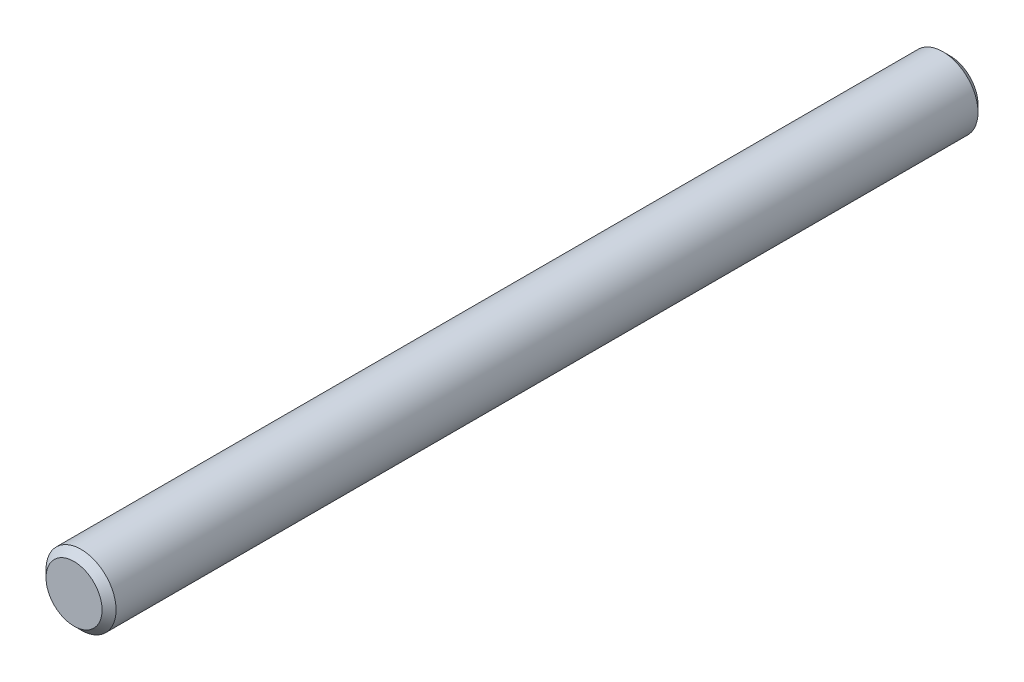
ISO-10303-21;
HEADER;
FILE_DESCRIPTION(('STEP AP214'),'2;1');
FILE_NAME('part.step','',(''),(''),'','','');
FILE_SCHEMA(('AUTOMOTIVE_DESIGN { 1 0 10303 214 1 1 1 1 }'));
ENDSEC;
DATA;
#1=APPLICATION_CONTEXT('core data for automotive mechanical design processes');
#2=APPLICATION_PROTOCOL_DEFINITION('international standard','automotive_design',2000,#1);
#3=PRODUCT_CONTEXT('',#1,'mechanical');
#4=PRODUCT('Part','Part','',(#3));
#5=PRODUCT_RELATED_PRODUCT_CATEGORY('part','',(#4));
#6=PRODUCT_DEFINITION_FORMATION('','',#4);
#7=PRODUCT_DEFINITION_CONTEXT('part definition',#1,'design');
#8=PRODUCT_DEFINITION('design','',#6,#7);
#9=PRODUCT_DEFINITION_SHAPE('','',#8);
#10=(LENGTH_UNIT() NAMED_UNIT(*) SI_UNIT(.MILLI.,.METRE.));
#11=(NAMED_UNIT(*) PLANE_ANGLE_UNIT() SI_UNIT($,.RADIAN.));
#12=(NAMED_UNIT(*) SI_UNIT($,.STERADIAN.) SOLID_ANGLE_UNIT());
#13=UNCERTAINTY_MEASURE_WITH_UNIT(LENGTH_MEASURE(1.E-05),#10,'distance_accuracy_value','');
#14=(GEOMETRIC_REPRESENTATION_CONTEXT(3) GLOBAL_UNCERTAINTY_ASSIGNED_CONTEXT((#13)) GLOBAL_UNIT_ASSIGNED_CONTEXT((#10,
#11,#12)) REPRESENTATION_CONTEXT('',''));
#15=CARTESIAN_POINT('',(0.,0.,0.));
#16=DIRECTION('',(0.,0.,1.));
#17=DIRECTION('',(1.,0.,0.));
#18=AXIS2_PLACEMENT_3D('',#15,#16,#17);
#19=CARTESIAN_POINT('',(0.,0.,100.));
#20=DIRECTION('',(0.,0.,-1.));
#21=DIRECTION('',(-1.,0.,0.));
#22=AXIS2_PLACEMENT_3D('',#19,#20,#21);
#23=CYLINDRICAL_SURFACE('',#22,4.);
#24=CARTESIAN_POINT('',(0.,0.,0.800000000000009));
#25=DIRECTION('',(0.,0.,1.));
#26=DIRECTION('',(1.,0.,0.));
#27=AXIS2_PLACEMENT_3D('',#24,#25,#26);
#28=CIRCLE('',#27,4.);
#29=CARTESIAN_POINT('',(4.,0.,0.800000000000009));
#30=VERTEX_POINT('',#29);
#31=EDGE_CURVE('E40',#30,#30,#28,.T.);
#32=ORIENTED_EDGE('',*,*,#31,.T.);
#33=EDGE_LOOP('',(#32));
#34=FACE_BOUND('',#33,.T.);
#35=CARTESIAN_POINT('',(0.,0.,99.2));
#36=DIRECTION('',(0.,0.,1.));
#37=DIRECTION('',(1.,0.,0.));
#38=AXIS2_PLACEMENT_3D('',#35,#36,#37);
#39=CIRCLE('',#38,4.);
#40=CARTESIAN_POINT('',(4.,0.,99.2));
#41=VERTEX_POINT('',#40);
#42=EDGE_CURVE('E48',#41,#41,#39,.F.);
#43=ORIENTED_EDGE('',*,*,#42,.T.);
#44=EDGE_LOOP('',(#43));
#45=FACE_BOUND('',#44,.T.);
#46=ADVANCED_FACE('F32',(#34,#45),#23,.T.);
#47=CARTESIAN_POINT('',(0.,0.,100.));
#48=DIRECTION('',(0.,0.,1.));
#49=DIRECTION('',(1.,0.,0.));
#50=AXIS2_PLACEMENT_3D('',#47,#48,#49);
#51=PLANE('',#50);
#52=CARTESIAN_POINT('',(0.,0.,100.));
#53=DIRECTION('',(0.,0.,1.));
#54=DIRECTION('',(1.,0.,0.));
#55=AXIS2_PLACEMENT_3D('',#52,#53,#54);
#56=CIRCLE('',#55,3.19999999999998);
#57=CARTESIAN_POINT('',(3.19999999999998,0.,100.));
#58=VERTEX_POINT('',#57);
#59=EDGE_CURVE('E44',#58,#58,#56,.T.);
#60=ORIENTED_EDGE('',*,*,#59,.T.);
#61=EDGE_LOOP('',(#60));
#62=FACE_BOUND('',#61,.T.);
#63=ADVANCED_FACE('F59',(#62),#51,.T.);
#64=CARTESIAN_POINT('',(0.,0.,100.));
#65=DIRECTION('',(0.,0.,-1.));
#66=DIRECTION('',(-1.,0.,0.));
#67=AXIS2_PLACEMENT_3D('',#64,#65,#66);
#68=CONICAL_SURFACE('',#67,3.19999999999998,0.785398163397455);
#69=ORIENTED_EDGE('',*,*,#42,.F.);
#70=EDGE_LOOP('',(#69));
#71=FACE_BOUND('',#70,.T.);
#72=ORIENTED_EDGE('',*,*,#59,.F.);
#73=EDGE_LOOP('',(#72));
#74=FACE_BOUND('',#73,.T.);
#75=ADVANCED_FACE('F55',(#71,#74),#68,.T.);
#76=CARTESIAN_POINT('',(-4.,4.,0.));
#77=DIRECTION('',(0.,0.,1.));
#78=DIRECTION('',(1.,0.,0.));
#79=AXIS2_PLACEMENT_3D('',#76,#77,#78);
#80=PLANE('',#79);
#81=CARTESIAN_POINT('',(0.,0.,0.));
#82=DIRECTION('',(0.,0.,1.));
#83=DIRECTION('',(1.,0.,0.));
#84=AXIS2_PLACEMENT_3D('',#81,#82,#83);
#85=CIRCLE('',#84,3.19999999999999);
#86=CARTESIAN_POINT('',(3.19999999999999,0.,0.));
#87=VERTEX_POINT('',#86);
#88=EDGE_CURVE('E10',#87,#87,#85,.F.);
#89=ORIENTED_EDGE('',*,*,#88,.T.);
#90=EDGE_LOOP('',(#89));
#91=FACE_BOUND('',#90,.T.);
#92=ADVANCED_FACE('F58',(#91),#80,.F.);
#93=CARTESIAN_POINT('',(0.,0.,0.800000000000009));
#94=DIRECTION('',(0.,0.,1.));
#95=DIRECTION('',(1.,0.,0.));
#96=AXIS2_PLACEMENT_3D('',#93,#94,#95);
#97=CONICAL_SURFACE('',#96,4.,0.785398163397446);
#98=ORIENTED_EDGE('',*,*,#88,.F.);
#99=EDGE_LOOP('',(#98));
#100=FACE_BOUND('',#99,.T.);
#101=ORIENTED_EDGE('',*,*,#31,.F.);
#102=EDGE_LOOP('',(#101));
#103=FACE_BOUND('',#102,.T.);
#104=ADVANCED_FACE('F35',(#100,#103),#97,.T.);
#105=CLOSED_SHELL('',(#46,#63,#75,#92,#104));
#106=MANIFOLD_SOLID_BREP('B2',#105);
#107=ADVANCED_BREP_SHAPE_REPRESENTATION('',(#18,#106),#14);
#108=SHAPE_DEFINITION_REPRESENTATION(#9,#107);
ENDSEC;
END-ISO-10303-21;
